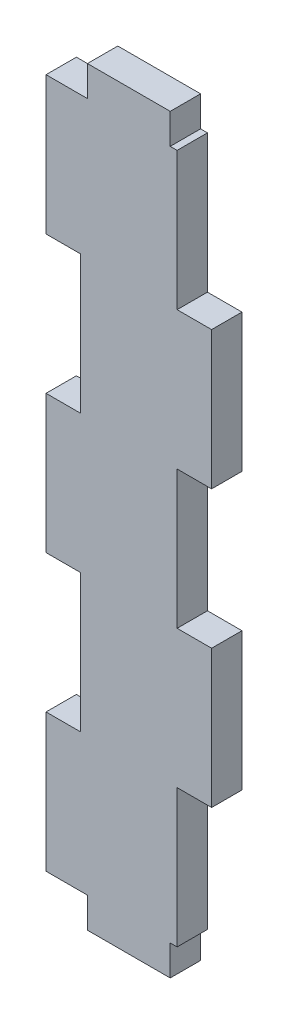
ISO-10303-21;
HEADER;
FILE_DESCRIPTION(('STEP AP214'),'2;1');
FILE_NAME('part.step','',(''),(''),'','','');
FILE_SCHEMA(('AUTOMOTIVE_DESIGN { 1 0 10303 214 1 1 1 1 }'));
ENDSEC;
DATA;
#1=APPLICATION_CONTEXT('core data for automotive mechanical design processes');
#2=APPLICATION_PROTOCOL_DEFINITION('international standard','automotive_design',2000,#1);
#3=PRODUCT_CONTEXT('',#1,'mechanical');
#4=PRODUCT('Part','Part','',(#3));
#5=PRODUCT_RELATED_PRODUCT_CATEGORY('part','',(#4));
#6=PRODUCT_DEFINITION_FORMATION('','',#4);
#7=PRODUCT_DEFINITION_CONTEXT('part definition',#1,'design');
#8=PRODUCT_DEFINITION('design','',#6,#7);
#9=PRODUCT_DEFINITION_SHAPE('','',#8);
#10=(LENGTH_UNIT() NAMED_UNIT(*) SI_UNIT(.MILLI.,.METRE.));
#11=(NAMED_UNIT(*) PLANE_ANGLE_UNIT() SI_UNIT($,.RADIAN.));
#12=(NAMED_UNIT(*) SI_UNIT($,.STERADIAN.) SOLID_ANGLE_UNIT());
#13=UNCERTAINTY_MEASURE_WITH_UNIT(LENGTH_MEASURE(1.E-05),#10,'distance_accuracy_value','');
#14=(GEOMETRIC_REPRESENTATION_CONTEXT(3) GLOBAL_UNCERTAINTY_ASSIGNED_CONTEXT((#13)) GLOBAL_UNIT_ASSIGNED_CONTEXT((#10,
#11,#12)) REPRESENTATION_CONTEXT('',''));
#15=CARTESIAN_POINT('',(0.,0.,0.));
#16=DIRECTION('',(0.,0.,1.));
#17=DIRECTION('',(1.,0.,0.));
#18=AXIS2_PLACEMENT_3D('',#15,#16,#17);
#19=CARTESIAN_POINT('',(7.,50.,4.4));
#20=DIRECTION('',(-1.,0.,0.));
#21=DIRECTION('',(0.,-1.,0.));
#22=AXIS2_PLACEMENT_3D('',#19,#20,#21);
#23=PLANE('',#22);
#24=DIRECTION('',(0.,1.,0.));
#25=VECTOR('',#24,1.);
#26=CARTESIAN_POINT('',(7.,50.,0.));
#27=LINE('',#26,#25);
#28=CARTESIAN_POINT('',(6.99999999999999,30.,0.));
#29=VERTEX_POINT('',#28);
#30=CARTESIAN_POINT('',(7.,50.,0.));
#31=VERTEX_POINT('',#30);
#32=EDGE_CURVE('E251',#29,#31,#27,.T.);
#33=ORIENTED_EDGE('',*,*,#32,.T.);
#34=DIRECTION('',(0.,0.,-1.));
#35=VECTOR('',#34,1.);
#36=CARTESIAN_POINT('',(7.,50.,4.4));
#37=LINE('',#36,#35);
#38=CARTESIAN_POINT('',(7.,50.,4.4));
#39=VERTEX_POINT('',#38);
#40=EDGE_CURVE('E11',#39,#31,#37,.T.);
#41=ORIENTED_EDGE('',*,*,#40,.F.);
#42=DIRECTION('',(0.,1.,0.));
#43=VECTOR('',#42,1.);
#44=CARTESIAN_POINT('',(7.,50.,4.4));
#45=LINE('',#44,#43);
#46=CARTESIAN_POINT('',(6.99999999999999,30.,4.4));
#47=VERTEX_POINT('',#46);
#48=EDGE_CURVE('E307',#47,#39,#45,.T.);
#49=ORIENTED_EDGE('',*,*,#48,.F.);
#50=DIRECTION('',(0.,0.,-1.));
#51=VECTOR('',#50,1.);
#52=CARTESIAN_POINT('',(6.99999999999999,30.,4.4));
#53=LINE('',#52,#51);
#54=EDGE_CURVE('E247',#47,#29,#53,.T.);
#55=ORIENTED_EDGE('',*,*,#54,.T.);
#56=EDGE_LOOP('',(#33,#41,#49,#55));
#57=FACE_BOUND('',#56,.T.);
#58=ADVANCED_FACE('F35',(#57),#23,.F.);
#59=CARTESIAN_POINT('',(6.,50.,4.4));
#60=DIRECTION('',(0.,-1.,0.));
#61=DIRECTION('',(0.,0.,-1.));
#62=AXIS2_PLACEMENT_3D('',#59,#60,#61);
#63=PLANE('',#62);
#64=DIRECTION('',(-1.,0.,0.));
#65=VECTOR('',#64,1.);
#66=CARTESIAN_POINT('',(6.,50.,0.));
#67=LINE('',#66,#65);
#68=CARTESIAN_POINT('',(6.,50.,0.));
#69=VERTEX_POINT('',#68);
#70=EDGE_CURVE('E254',#31,#69,#67,.T.);
#71=ORIENTED_EDGE('',*,*,#70,.T.);
#72=DIRECTION('',(0.,0.,-1.));
#73=VECTOR('',#72,1.);
#74=CARTESIAN_POINT('',(6.,50.,4.4));
#75=LINE('',#74,#73);
#76=CARTESIAN_POINT('',(6.,50.,4.4));
#77=VERTEX_POINT('',#76);
#78=EDGE_CURVE('E43',#77,#69,#75,.T.);
#79=ORIENTED_EDGE('',*,*,#78,.F.);
#80=DIRECTION('',(-1.,0.,0.));
#81=VECTOR('',#80,1.);
#82=CARTESIAN_POINT('',(6.,50.,4.4));
#83=LINE('',#82,#81);
#84=EDGE_CURVE('E154',#39,#77,#83,.T.);
#85=ORIENTED_EDGE('',*,*,#84,.F.);
#86=ORIENTED_EDGE('',*,*,#40,.T.);
#87=EDGE_LOOP('',(#71,#79,#85,#86));
#88=FACE_BOUND('',#87,.T.);
#89=ADVANCED_FACE('F464',(#88),#63,.F.);
#90=CARTESIAN_POINT('',(6.,50.,4.4));
#91=DIRECTION('',(-1.,0.,0.));
#92=DIRECTION('',(0.,0.,1.));
#93=AXIS2_PLACEMENT_3D('',#90,#91,#92);
#94=PLANE('',#93);
#95=DIRECTION('',(0.,1.,0.));
#96=VECTOR('',#95,1.);
#97=CARTESIAN_POINT('',(6.,50.,0.));
#98=LINE('',#97,#96);
#99=CARTESIAN_POINT('',(6.,54.4,0.));
#100=VERTEX_POINT('',#99);
#101=EDGE_CURVE('E256',#69,#100,#98,.T.);
#102=ORIENTED_EDGE('',*,*,#101,.T.);
#103=DIRECTION('',(0.,0.,-1.));
#104=VECTOR('',#103,1.);
#105=CARTESIAN_POINT('',(6.,54.4,4.4));
#106=LINE('',#105,#104);
#107=CARTESIAN_POINT('',(6.,54.4,4.4));
#108=VERTEX_POINT('',#107);
#109=EDGE_CURVE('E374',#108,#100,#106,.T.);
#110=ORIENTED_EDGE('',*,*,#109,.F.);
#111=DIRECTION('',(0.,1.,0.));
#112=VECTOR('',#111,1.);
#113=CARTESIAN_POINT('',(6.,50.,4.4));
#114=LINE('',#113,#112);
#115=EDGE_CURVE('E382',#77,#108,#114,.T.);
#116=ORIENTED_EDGE('',*,*,#115,.F.);
#117=ORIENTED_EDGE('',*,*,#78,.T.);
#118=EDGE_LOOP('',(#102,#110,#116,#117));
#119=FACE_BOUND('',#118,.T.);
#120=ADVANCED_FACE('F380',(#119),#94,.F.);
#121=CARTESIAN_POINT('',(6.,54.4,4.4));
#122=DIRECTION('',(0.,-1.,0.));
#123=DIRECTION('',(0.,0.,-1.));
#124=AXIS2_PLACEMENT_3D('',#121,#122,#123);
#125=PLANE('',#124);
#126=DIRECTION('',(-1.,0.,0.));
#127=VECTOR('',#126,1.);
#128=CARTESIAN_POINT('',(6.,54.4,0.));
#129=LINE('',#128,#127);
#130=CARTESIAN_POINT('',(-6.,54.4,0.));
#131=VERTEX_POINT('',#130);
#132=EDGE_CURVE('E258',#100,#131,#129,.T.);
#133=ORIENTED_EDGE('',*,*,#132,.T.);
#134=DIRECTION('',(0.,0.,-1.));
#135=VECTOR('',#134,1.);
#136=CARTESIAN_POINT('',(-6.,54.4,4.4));
#137=LINE('',#136,#135);
#138=CARTESIAN_POINT('',(-6.,54.4,4.4));
#139=VERTEX_POINT('',#138);
#140=EDGE_CURVE('E371',#139,#131,#137,.T.);
#141=ORIENTED_EDGE('',*,*,#140,.F.);
#142=DIRECTION('',(-1.,0.,0.));
#143=VECTOR('',#142,1.);
#144=CARTESIAN_POINT('',(6.,54.4,4.4));
#145=LINE('',#144,#143);
#146=EDGE_CURVE('E399',#108,#139,#145,.T.);
#147=ORIENTED_EDGE('',*,*,#146,.F.);
#148=ORIENTED_EDGE('',*,*,#109,.T.);
#149=EDGE_LOOP('',(#133,#141,#147,#148));
#150=FACE_BOUND('',#149,.T.);
#151=ADVANCED_FACE('F390',(#150),#125,.F.);
#152=CARTESIAN_POINT('',(-6.,50.,4.4));
#153=DIRECTION('',(1.,0.,0.));
#154=DIRECTION('',(0.,0.,-1.));
#155=AXIS2_PLACEMENT_3D('',#152,#153,#154);
#156=PLANE('',#155);
#157=DIRECTION('',(0.,-1.,0.));
#158=VECTOR('',#157,1.);
#159=CARTESIAN_POINT('',(-6.,50.,0.));
#160=LINE('',#159,#158);
#161=CARTESIAN_POINT('',(-6.,50.,0.));
#162=VERTEX_POINT('',#161);
#163=EDGE_CURVE('E260',#131,#162,#160,.T.);
#164=ORIENTED_EDGE('',*,*,#163,.T.);
#165=DIRECTION('',(0.,0.,-1.));
#166=VECTOR('',#165,1.);
#167=CARTESIAN_POINT('',(-6.,50.,4.4));
#168=LINE('',#167,#166);
#169=CARTESIAN_POINT('',(-6.,50.,4.4));
#170=VERTEX_POINT('',#169);
#171=EDGE_CURVE('E368',#170,#162,#168,.T.);
#172=ORIENTED_EDGE('',*,*,#171,.F.);
#173=DIRECTION('',(0.,-1.,0.));
#174=VECTOR('',#173,1.);
#175=CARTESIAN_POINT('',(-6.,50.,4.4));
#176=LINE('',#175,#174);
#177=EDGE_CURVE('E396',#139,#170,#176,.T.);
#178=ORIENTED_EDGE('',*,*,#177,.F.);
#179=ORIENTED_EDGE('',*,*,#140,.T.);
#180=EDGE_LOOP('',(#164,#172,#178,#179));
#181=FACE_BOUND('',#180,.T.);
#182=ADVANCED_FACE('F394',(#181),#156,.F.);
#183=CARTESIAN_POINT('',(-7.00000000000001,50.,4.4));
#184=DIRECTION('',(0.,-1.,0.));
#185=DIRECTION('',(0.,0.,-1.));
#186=AXIS2_PLACEMENT_3D('',#183,#184,#185);
#187=PLANE('',#186);
#188=DIRECTION('',(-1.,0.,0.));
#189=VECTOR('',#188,1.);
#190=CARTESIAN_POINT('',(-7.00000000000001,50.,0.));
#191=LINE('',#190,#189);
#192=CARTESIAN_POINT('',(-12.,50.,0.));
#193=VERTEX_POINT('',#192);
#194=EDGE_CURVE('E263',#162,#193,#191,.T.);
#195=ORIENTED_EDGE('',*,*,#194,.T.);
#196=DIRECTION('',(0.,0.,-1.));
#197=VECTOR('',#196,1.);
#198=CARTESIAN_POINT('',(-12.,50.,4.4));
#199=LINE('',#198,#197);
#200=CARTESIAN_POINT('',(-12.,50.,4.4));
#201=VERTEX_POINT('',#200);
#202=EDGE_CURVE('E365',#201,#193,#199,.T.);
#203=ORIENTED_EDGE('',*,*,#202,.F.);
#204=DIRECTION('',(-1.,0.,0.));
#205=VECTOR('',#204,1.);
#206=CARTESIAN_POINT('',(-7.00000000000001,50.,4.4));
#207=LINE('',#206,#205);
#208=EDGE_CURVE('E398',#170,#201,#207,.T.);
#209=ORIENTED_EDGE('',*,*,#208,.F.);
#210=ORIENTED_EDGE('',*,*,#171,.T.);
#211=EDGE_LOOP('',(#195,#203,#209,#210));
#212=FACE_BOUND('',#211,.T.);
#213=ADVANCED_FACE('F477',(#212),#187,.F.);
#214=CARTESIAN_POINT('',(-12.,50.,4.4));
#215=DIRECTION('',(1.,0.,0.));
#216=DIRECTION('',(0.,0.,-1.));
#217=AXIS2_PLACEMENT_3D('',#214,#215,#216);
#218=PLANE('',#217);
#219=DIRECTION('',(0.,-1.,0.));
#220=VECTOR('',#219,1.);
#221=CARTESIAN_POINT('',(-12.,50.,0.));
#222=LINE('',#221,#220);
#223=CARTESIAN_POINT('',(-12.,30.,0.));
#224=VERTEX_POINT('',#223);
#225=EDGE_CURVE('E265',#193,#224,#222,.T.);
#226=ORIENTED_EDGE('',*,*,#225,.T.);
#227=DIRECTION('',(0.,0.,-1.));
#228=VECTOR('',#227,1.);
#229=CARTESIAN_POINT('',(-12.,30.,4.4));
#230=LINE('',#229,#228);
#231=CARTESIAN_POINT('',(-12.,30.,4.4));
#232=VERTEX_POINT('',#231);
#233=EDGE_CURVE('E362',#232,#224,#230,.T.);
#234=ORIENTED_EDGE('',*,*,#233,.F.);
#235=DIRECTION('',(0.,-1.,0.));
#236=VECTOR('',#235,1.);
#237=CARTESIAN_POINT('',(-12.,50.,4.4));
#238=LINE('',#237,#236);
#239=EDGE_CURVE('E401',#201,#232,#238,.T.);
#240=ORIENTED_EDGE('',*,*,#239,.F.);
#241=ORIENTED_EDGE('',*,*,#202,.T.);
#242=EDGE_LOOP('',(#226,#234,#240,#241));
#243=FACE_BOUND('',#242,.T.);
#244=ADVANCED_FACE('F480',(#243),#218,.F.);
#245=CARTESIAN_POINT('',(-12.,30.,4.4));
#246=DIRECTION('',(0.,1.,0.));
#247=DIRECTION('',(-1.,0.,0.));
#248=AXIS2_PLACEMENT_3D('',#245,#246,#247);
#249=PLANE('',#248);
#250=DIRECTION('',(1.,0.,0.));
#251=VECTOR('',#250,1.);
#252=CARTESIAN_POINT('',(-12.,30.,0.));
#253=LINE('',#252,#251);
#254=CARTESIAN_POINT('',(-7.00000000000001,30.,0.));
#255=VERTEX_POINT('',#254);
#256=EDGE_CURVE('E267',#224,#255,#253,.T.);
#257=ORIENTED_EDGE('',*,*,#256,.T.);
#258=DIRECTION('',(0.,0.,-1.));
#259=VECTOR('',#258,1.);
#260=CARTESIAN_POINT('',(-7.00000000000001,30.,4.4));
#261=LINE('',#260,#259);
#262=CARTESIAN_POINT('',(-7.00000000000001,30.,4.4));
#263=VERTEX_POINT('',#262);
#264=EDGE_CURVE('E359',#263,#255,#261,.T.);
#265=ORIENTED_EDGE('',*,*,#264,.F.);
#266=DIRECTION('',(1.,0.,0.));
#267=VECTOR('',#266,1.);
#268=CARTESIAN_POINT('',(-12.,30.,4.4));
#269=LINE('',#268,#267);
#270=EDGE_CURVE('E407',#232,#263,#269,.T.);
#271=ORIENTED_EDGE('',*,*,#270,.F.);
#272=ORIENTED_EDGE('',*,*,#233,.T.);
#273=EDGE_LOOP('',(#257,#265,#271,#272));
#274=FACE_BOUND('',#273,.T.);
#275=ADVANCED_FACE('F484',(#274),#249,.F.);
#276=CARTESIAN_POINT('',(-7.00000000000001,30.,4.4));
#277=DIRECTION('',(1.,0.,0.));
#278=DIRECTION('',(0.,1.,0.));
#279=AXIS2_PLACEMENT_3D('',#276,#277,#278);
#280=PLANE('',#279);
#281=DIRECTION('',(0.,-1.,0.));
#282=VECTOR('',#281,1.);
#283=CARTESIAN_POINT('',(-7.00000000000001,30.,0.));
#284=LINE('',#283,#282);
#285=CARTESIAN_POINT('',(-7.00000000000001,10.,0.));
#286=VERTEX_POINT('',#285);
#287=EDGE_CURVE('E269',#255,#286,#284,.T.);
#288=ORIENTED_EDGE('',*,*,#287,.T.);
#289=DIRECTION('',(0.,0.,-1.));
#290=VECTOR('',#289,1.);
#291=CARTESIAN_POINT('',(-7.00000000000001,10.,4.4));
#292=LINE('',#291,#290);
#293=CARTESIAN_POINT('',(-7.00000000000001,10.,4.4));
#294=VERTEX_POINT('',#293);
#295=EDGE_CURVE('E356',#294,#286,#292,.T.);
#296=ORIENTED_EDGE('',*,*,#295,.F.);
#297=DIRECTION('',(0.,-1.,0.));
#298=VECTOR('',#297,1.);
#299=CARTESIAN_POINT('',(-7.00000000000001,30.,4.4));
#300=LINE('',#299,#298);
#301=EDGE_CURVE('E409',#263,#294,#300,.T.);
#302=ORIENTED_EDGE('',*,*,#301,.F.);
#303=ORIENTED_EDGE('',*,*,#264,.T.);
#304=EDGE_LOOP('',(#288,#296,#302,#303));
#305=FACE_BOUND('',#304,.T.);
#306=ADVANCED_FACE('F488',(#305),#280,.F.);
#307=CARTESIAN_POINT('',(-7.00000000000001,10.,4.4));
#308=DIRECTION('',(0.,-1.,0.));
#309=DIRECTION('',(0.,0.,-1.));
#310=AXIS2_PLACEMENT_3D('',#307,#308,#309);
#311=PLANE('',#310);
#312=DIRECTION('',(-1.,0.,0.));
#313=VECTOR('',#312,1.);
#314=CARTESIAN_POINT('',(-7.00000000000001,10.,0.));
#315=LINE('',#314,#313);
#316=CARTESIAN_POINT('',(-12.,10.,0.));
#317=VERTEX_POINT('',#316);
#318=EDGE_CURVE('E271',#286,#317,#315,.T.);
#319=ORIENTED_EDGE('',*,*,#318,.T.);
#320=DIRECTION('',(0.,0.,-1.));
#321=VECTOR('',#320,1.);
#322=CARTESIAN_POINT('',(-12.,10.,4.4));
#323=LINE('',#322,#321);
#324=CARTESIAN_POINT('',(-12.,10.,4.4));
#325=VERTEX_POINT('',#324);
#326=EDGE_CURVE('E353',#325,#317,#323,.T.);
#327=ORIENTED_EDGE('',*,*,#326,.F.);
#328=DIRECTION('',(-1.,0.,0.));
#329=VECTOR('',#328,1.);
#330=CARTESIAN_POINT('',(-7.00000000000001,10.,4.4));
#331=LINE('',#330,#329);
#332=EDGE_CURVE('E411',#294,#325,#331,.T.);
#333=ORIENTED_EDGE('',*,*,#332,.F.);
#334=ORIENTED_EDGE('',*,*,#295,.T.);
#335=EDGE_LOOP('',(#319,#327,#333,#334));
#336=FACE_BOUND('',#335,.T.);
#337=ADVANCED_FACE('F492',(#336),#311,.F.);
#338=CARTESIAN_POINT('',(-12.,10.,4.4));
#339=DIRECTION('',(1.,0.,0.));
#340=DIRECTION('',(0.,0.,-1.));
#341=AXIS2_PLACEMENT_3D('',#338,#339,#340);
#342=PLANE('',#341);
#343=DIRECTION('',(0.,-1.,0.));
#344=VECTOR('',#343,1.);
#345=CARTESIAN_POINT('',(-12.,10.,0.));
#346=LINE('',#345,#344);
#347=CARTESIAN_POINT('',(-12.,-10.,0.));
#348=VERTEX_POINT('',#347);
#349=EDGE_CURVE('E273',#317,#348,#346,.T.);
#350=ORIENTED_EDGE('',*,*,#349,.T.);
#351=DIRECTION('',(0.,0.,-1.));
#352=VECTOR('',#351,1.);
#353=CARTESIAN_POINT('',(-12.,-10.,4.4));
#354=LINE('',#353,#352);
#355=CARTESIAN_POINT('',(-12.,-10.,4.4));
#356=VERTEX_POINT('',#355);
#357=EDGE_CURVE('E350',#356,#348,#354,.T.);
#358=ORIENTED_EDGE('',*,*,#357,.F.);
#359=DIRECTION('',(0.,-1.,0.));
#360=VECTOR('',#359,1.);
#361=CARTESIAN_POINT('',(-12.,10.,4.4));
#362=LINE('',#361,#360);
#363=EDGE_CURVE('E413',#325,#356,#362,.T.);
#364=ORIENTED_EDGE('',*,*,#363,.F.);
#365=ORIENTED_EDGE('',*,*,#326,.T.);
#366=EDGE_LOOP('',(#350,#358,#364,#365));
#367=FACE_BOUND('',#366,.T.);
#368=ADVANCED_FACE('F496',(#367),#342,.F.);
#369=CARTESIAN_POINT('',(-12.,-10.,4.4));
#370=DIRECTION('',(0.,1.,0.));
#371=DIRECTION('',(-1.,0.,0.));
#372=AXIS2_PLACEMENT_3D('',#369,#370,#371);
#373=PLANE('',#372);
#374=DIRECTION('',(1.,0.,0.));
#375=VECTOR('',#374,1.);
#376=CARTESIAN_POINT('',(-12.,-10.,0.));
#377=LINE('',#376,#375);
#378=CARTESIAN_POINT('',(-7.00000000000001,-10.,0.));
#379=VERTEX_POINT('',#378);
#380=EDGE_CURVE('E275',#348,#379,#377,.T.);
#381=ORIENTED_EDGE('',*,*,#380,.T.);
#382=DIRECTION('',(0.,0.,-1.));
#383=VECTOR('',#382,1.);
#384=CARTESIAN_POINT('',(-7.00000000000001,-10.,4.4));
#385=LINE('',#384,#383);
#386=CARTESIAN_POINT('',(-7.00000000000001,-10.,4.4));
#387=VERTEX_POINT('',#386);
#388=EDGE_CURVE('E347',#387,#379,#385,.T.);
#389=ORIENTED_EDGE('',*,*,#388,.F.);
#390=DIRECTION('',(1.,0.,0.));
#391=VECTOR('',#390,1.);
#392=CARTESIAN_POINT('',(-12.,-10.,4.4));
#393=LINE('',#392,#391);
#394=EDGE_CURVE('E415',#356,#387,#393,.T.);
#395=ORIENTED_EDGE('',*,*,#394,.F.);
#396=ORIENTED_EDGE('',*,*,#357,.T.);
#397=EDGE_LOOP('',(#381,#389,#395,#396));
#398=FACE_BOUND('',#397,.T.);
#399=ADVANCED_FACE('F500',(#398),#373,.F.);
#400=CARTESIAN_POINT('',(-7.00000000000001,-30.,4.4));
#401=DIRECTION('',(1.,0.,0.));
#402=DIRECTION('',(0.,1.,0.));
#403=AXIS2_PLACEMENT_3D('',#400,#401,#402);
#404=PLANE('',#403);
#405=DIRECTION('',(0.,-1.,0.));
#406=VECTOR('',#405,1.);
#407=CARTESIAN_POINT('',(-7.00000000000001,-30.,0.));
#408=LINE('',#407,#406);
#409=CARTESIAN_POINT('',(-7.00000000000001,-30.,0.));
#410=VERTEX_POINT('',#409);
#411=EDGE_CURVE('E277',#379,#410,#408,.T.);
#412=ORIENTED_EDGE('',*,*,#411,.T.);
#413=DIRECTION('',(0.,0.,-1.));
#414=VECTOR('',#413,1.);
#415=CARTESIAN_POINT('',(-7.00000000000001,-30.,4.4));
#416=LINE('',#415,#414);
#417=CARTESIAN_POINT('',(-7.00000000000001,-30.,4.4));
#418=VERTEX_POINT('',#417);
#419=EDGE_CURVE('E344',#418,#410,#416,.T.);
#420=ORIENTED_EDGE('',*,*,#419,.F.);
#421=DIRECTION('',(0.,-1.,0.));
#422=VECTOR('',#421,1.);
#423=CARTESIAN_POINT('',(-7.00000000000001,-30.,4.4));
#424=LINE('',#423,#422);
#425=EDGE_CURVE('E417',#387,#418,#424,.T.);
#426=ORIENTED_EDGE('',*,*,#425,.F.);
#427=ORIENTED_EDGE('',*,*,#388,.T.);
#428=EDGE_LOOP('',(#412,#420,#426,#427));
#429=FACE_BOUND('',#428,.T.);
#430=ADVANCED_FACE('F504',(#429),#404,.F.);
#431=CARTESIAN_POINT('',(-7.00000000000001,-30.,4.4));
#432=DIRECTION('',(0.,-1.,0.));
#433=DIRECTION('',(0.,0.,-1.));
#434=AXIS2_PLACEMENT_3D('',#431,#432,#433);
#435=PLANE('',#434);
#436=DIRECTION('',(-1.,0.,0.));
#437=VECTOR('',#436,1.);
#438=CARTESIAN_POINT('',(-7.00000000000001,-30.,0.));
#439=LINE('',#438,#437);
#440=CARTESIAN_POINT('',(-12.,-30.,0.));
#441=VERTEX_POINT('',#440);
#442=EDGE_CURVE('E279',#410,#441,#439,.T.);
#443=ORIENTED_EDGE('',*,*,#442,.T.);
#444=DIRECTION('',(0.,0.,-1.));
#445=VECTOR('',#444,1.);
#446=CARTESIAN_POINT('',(-12.,-30.,4.4));
#447=LINE('',#446,#445);
#448=CARTESIAN_POINT('',(-12.,-30.,4.4));
#449=VERTEX_POINT('',#448);
#450=EDGE_CURVE('E341',#449,#441,#447,.T.);
#451=ORIENTED_EDGE('',*,*,#450,.F.);
#452=DIRECTION('',(-1.,0.,0.));
#453=VECTOR('',#452,1.);
#454=CARTESIAN_POINT('',(-7.00000000000001,-30.,4.4));
#455=LINE('',#454,#453);
#456=EDGE_CURVE('E419',#418,#449,#455,.T.);
#457=ORIENTED_EDGE('',*,*,#456,.F.);
#458=ORIENTED_EDGE('',*,*,#419,.T.);
#459=EDGE_LOOP('',(#443,#451,#457,#458));
#460=FACE_BOUND('',#459,.T.);
#461=ADVANCED_FACE('F508',(#460),#435,.F.);
#462=CARTESIAN_POINT('',(-12.,-30.,4.4));
#463=DIRECTION('',(1.,0.,0.));
#464=DIRECTION('',(0.,0.,-1.));
#465=AXIS2_PLACEMENT_3D('',#462,#463,#464);
#466=PLANE('',#465);
#467=DIRECTION('',(0.,-1.,0.));
#468=VECTOR('',#467,1.);
#469=CARTESIAN_POINT('',(-12.,-30.,0.));
#470=LINE('',#469,#468);
#471=CARTESIAN_POINT('',(-12.,-50.,0.));
#472=VERTEX_POINT('',#471);
#473=EDGE_CURVE('E281',#441,#472,#470,.T.);
#474=ORIENTED_EDGE('',*,*,#473,.T.);
#475=DIRECTION('',(0.,0.,-1.));
#476=VECTOR('',#475,1.);
#477=CARTESIAN_POINT('',(-12.,-50.,4.4));
#478=LINE('',#477,#476);
#479=CARTESIAN_POINT('',(-12.,-50.,4.4));
#480=VERTEX_POINT('',#479);
#481=EDGE_CURVE('E338',#480,#472,#478,.T.);
#482=ORIENTED_EDGE('',*,*,#481,.F.);
#483=DIRECTION('',(0.,-1.,0.));
#484=VECTOR('',#483,1.);
#485=CARTESIAN_POINT('',(-12.,-30.,4.4));
#486=LINE('',#485,#484);
#487=EDGE_CURVE('E421',#449,#480,#486,.T.);
#488=ORIENTED_EDGE('',*,*,#487,.F.);
#489=ORIENTED_EDGE('',*,*,#450,.T.);
#490=EDGE_LOOP('',(#474,#482,#488,#489));
#491=FACE_BOUND('',#490,.T.);
#492=ADVANCED_FACE('F512',(#491),#466,.F.);
#493=CARTESIAN_POINT('',(-7.00000000000001,-50.,4.4));
#494=DIRECTION('',(0.,1.,0.));
#495=DIRECTION('',(0.,0.,1.));
#496=AXIS2_PLACEMENT_3D('',#493,#494,#495);
#497=PLANE('',#496);
#498=DIRECTION('',(1.,0.,0.));
#499=VECTOR('',#498,1.);
#500=CARTESIAN_POINT('',(-7.00000000000001,-50.,0.));
#501=LINE('',#500,#499);
#502=CARTESIAN_POINT('',(-6.,-50.,0.));
#503=VERTEX_POINT('',#502);
#504=EDGE_CURVE('E284',#472,#503,#501,.T.);
#505=ORIENTED_EDGE('',*,*,#504,.T.);
#506=DIRECTION('',(0.,0.,-1.));
#507=VECTOR('',#506,1.);
#508=CARTESIAN_POINT('',(-6.,-50.,4.4));
#509=LINE('',#508,#507);
#510=CARTESIAN_POINT('',(-6.,-50.,4.4));
#511=VERTEX_POINT('',#510);
#512=EDGE_CURVE('E335',#511,#503,#509,.T.);
#513=ORIENTED_EDGE('',*,*,#512,.F.);
#514=DIRECTION('',(1.,0.,0.));
#515=VECTOR('',#514,1.);
#516=CARTESIAN_POINT('',(-12.,-50.,4.4));
#517=LINE('',#516,#515);
#518=EDGE_CURVE('E423',#480,#511,#517,.T.);
#519=ORIENTED_EDGE('',*,*,#518,.F.);
#520=ORIENTED_EDGE('',*,*,#481,.T.);
#521=EDGE_LOOP('',(#505,#513,#519,#520));
#522=FACE_BOUND('',#521,.T.);
#523=ADVANCED_FACE('F516',(#522),#497,.F.);
#524=CARTESIAN_POINT('',(-6.,-50.,4.4));
#525=DIRECTION('',(1.,0.,0.));
#526=DIRECTION('',(0.,0.,-1.));
#527=AXIS2_PLACEMENT_3D('',#524,#525,#526);
#528=PLANE('',#527);
#529=DIRECTION('',(0.,-1.,0.));
#530=VECTOR('',#529,1.);
#531=CARTESIAN_POINT('',(-6.,-50.,0.));
#532=LINE('',#531,#530);
#533=CARTESIAN_POINT('',(-6.,-54.4,0.));
#534=VERTEX_POINT('',#533);
#535=EDGE_CURVE('E286',#503,#534,#532,.T.);
#536=ORIENTED_EDGE('',*,*,#535,.T.);
#537=DIRECTION('',(0.,0.,-1.));
#538=VECTOR('',#537,1.);
#539=CARTESIAN_POINT('',(-6.,-54.4,4.4));
#540=LINE('',#539,#538);
#541=CARTESIAN_POINT('',(-6.,-54.4,4.4));
#542=VERTEX_POINT('',#541);
#543=EDGE_CURVE('E332',#542,#534,#540,.T.);
#544=ORIENTED_EDGE('',*,*,#543,.F.);
#545=DIRECTION('',(0.,-1.,0.));
#546=VECTOR('',#545,1.);
#547=CARTESIAN_POINT('',(-6.,-50.,4.4));
#548=LINE('',#547,#546);
#549=EDGE_CURVE('E425',#511,#542,#548,.T.);
#550=ORIENTED_EDGE('',*,*,#549,.F.);
#551=ORIENTED_EDGE('',*,*,#512,.T.);
#552=EDGE_LOOP('',(#536,#544,#550,#551));
#553=FACE_BOUND('',#552,.T.);
#554=ADVANCED_FACE('F520',(#553),#528,.F.);
#555=CARTESIAN_POINT('',(6.,-54.4,4.4));
#556=DIRECTION('',(0.,1.,0.));
#557=DIRECTION('',(0.,0.,1.));
#558=AXIS2_PLACEMENT_3D('',#555,#556,#557);
#559=PLANE('',#558);
#560=DIRECTION('',(1.,0.,0.));
#561=VECTOR('',#560,1.);
#562=CARTESIAN_POINT('',(6.,-54.4,0.));
#563=LINE('',#562,#561);
#564=CARTESIAN_POINT('',(6.,-54.4,0.));
#565=VERTEX_POINT('',#564);
#566=EDGE_CURVE('E288',#534,#565,#563,.T.);
#567=ORIENTED_EDGE('',*,*,#566,.T.);
#568=DIRECTION('',(0.,0.,-1.));
#569=VECTOR('',#568,1.);
#570=CARTESIAN_POINT('',(6.,-54.4,4.4));
#571=LINE('',#570,#569);
#572=CARTESIAN_POINT('',(6.,-54.4,4.4));
#573=VERTEX_POINT('',#572);
#574=EDGE_CURVE('E329',#573,#565,#571,.T.);
#575=ORIENTED_EDGE('',*,*,#574,.F.);
#576=DIRECTION('',(1.,0.,0.));
#577=VECTOR('',#576,1.);
#578=CARTESIAN_POINT('',(6.,-54.4,4.4));
#579=LINE('',#578,#577);
#580=EDGE_CURVE('E427',#542,#573,#579,.T.);
#581=ORIENTED_EDGE('',*,*,#580,.F.);
#582=ORIENTED_EDGE('',*,*,#543,.T.);
#583=EDGE_LOOP('',(#567,#575,#581,#582));
#584=FACE_BOUND('',#583,.T.);
#585=ADVANCED_FACE('F524',(#584),#559,.F.);
#586=CARTESIAN_POINT('',(6.,-50.,4.4));
#587=DIRECTION('',(-1.,0.,0.));
#588=DIRECTION('',(0.,0.,1.));
#589=AXIS2_PLACEMENT_3D('',#586,#587,#588);
#590=PLANE('',#589);
#591=DIRECTION('',(0.,1.,0.));
#592=VECTOR('',#591,1.);
#593=CARTESIAN_POINT('',(6.,-50.,0.));
#594=LINE('',#593,#592);
#595=CARTESIAN_POINT('',(6.,-50.,0.));
#596=VERTEX_POINT('',#595);
#597=EDGE_CURVE('E290',#565,#596,#594,.T.);
#598=ORIENTED_EDGE('',*,*,#597,.T.);
#599=DIRECTION('',(0.,0.,-1.));
#600=VECTOR('',#599,1.);
#601=CARTESIAN_POINT('',(6.,-50.,4.4));
#602=LINE('',#601,#600);
#603=CARTESIAN_POINT('',(6.,-50.,4.4));
#604=VERTEX_POINT('',#603);
#605=EDGE_CURVE('E326',#604,#596,#602,.T.);
#606=ORIENTED_EDGE('',*,*,#605,.F.);
#607=DIRECTION('',(0.,1.,0.));
#608=VECTOR('',#607,1.);
#609=CARTESIAN_POINT('',(6.,-50.,4.4));
#610=LINE('',#609,#608);
#611=EDGE_CURVE('E429',#573,#604,#610,.T.);
#612=ORIENTED_EDGE('',*,*,#611,.F.);
#613=ORIENTED_EDGE('',*,*,#574,.T.);
#614=EDGE_LOOP('',(#598,#606,#612,#613));
#615=FACE_BOUND('',#614,.T.);
#616=ADVANCED_FACE('F528',(#615),#590,.F.);
#617=CARTESIAN_POINT('',(6.,-50.,4.4));
#618=DIRECTION('',(0.,1.,0.));
#619=DIRECTION('',(0.,0.,1.));
#620=AXIS2_PLACEMENT_3D('',#617,#618,#619);
#621=PLANE('',#620);
#622=DIRECTION('',(1.,0.,0.));
#623=VECTOR('',#622,1.);
#624=CARTESIAN_POINT('',(6.,-50.,0.));
#625=LINE('',#624,#623);
#626=CARTESIAN_POINT('',(7.,-50.,0.));
#627=VERTEX_POINT('',#626);
#628=EDGE_CURVE('E292',#596,#627,#625,.T.);
#629=ORIENTED_EDGE('',*,*,#628,.T.);
#630=DIRECTION('',(0.,0.,-1.));
#631=VECTOR('',#630,1.);
#632=CARTESIAN_POINT('',(7.,-50.,4.4));
#633=LINE('',#632,#631);
#634=CARTESIAN_POINT('',(7.,-50.,4.4));
#635=VERTEX_POINT('',#634);
#636=EDGE_CURVE('E323',#635,#627,#633,.T.);
#637=ORIENTED_EDGE('',*,*,#636,.F.);
#638=DIRECTION('',(1.,0.,0.));
#639=VECTOR('',#638,1.);
#640=CARTESIAN_POINT('',(6.,-50.,4.4));
#641=LINE('',#640,#639);
#642=EDGE_CURVE('E431',#604,#635,#641,.T.);
#643=ORIENTED_EDGE('',*,*,#642,.F.);
#644=ORIENTED_EDGE('',*,*,#605,.T.);
#645=EDGE_LOOP('',(#629,#637,#643,#644));
#646=FACE_BOUND('',#645,.T.);
#647=ADVANCED_FACE('F532',(#646),#621,.F.);
#648=CARTESIAN_POINT('',(7.,-30.,4.4));
#649=DIRECTION('',(-1.,0.,0.));
#650=DIRECTION('',(0.,-1.,0.));
#651=AXIS2_PLACEMENT_3D('',#648,#649,#650);
#652=PLANE('',#651);
#653=DIRECTION('',(0.,1.,0.));
#654=VECTOR('',#653,1.);
#655=CARTESIAN_POINT('',(7.,-30.,0.));
#656=LINE('',#655,#654);
#657=CARTESIAN_POINT('',(7.,-30.,0.));
#658=VERTEX_POINT('',#657);
#659=EDGE_CURVE('E294',#627,#658,#656,.T.);
#660=ORIENTED_EDGE('',*,*,#659,.T.);
#661=DIRECTION('',(0.,0.,-1.));
#662=VECTOR('',#661,1.);
#663=CARTESIAN_POINT('',(7.,-30.,4.4));
#664=LINE('',#663,#662);
#665=CARTESIAN_POINT('',(7.,-30.,4.4));
#666=VERTEX_POINT('',#665);
#667=EDGE_CURVE('E320',#666,#658,#664,.T.);
#668=ORIENTED_EDGE('',*,*,#667,.F.);
#669=DIRECTION('',(0.,1.,0.));
#670=VECTOR('',#669,1.);
#671=CARTESIAN_POINT('',(7.,-30.,4.4));
#672=LINE('',#671,#670);
#673=EDGE_CURVE('E433',#635,#666,#672,.T.);
#674=ORIENTED_EDGE('',*,*,#673,.F.);
#675=ORIENTED_EDGE('',*,*,#636,.T.);
#676=EDGE_LOOP('',(#660,#668,#674,#675));
#677=FACE_BOUND('',#676,.T.);
#678=ADVANCED_FACE('F536',(#677),#652,.F.);
#679=CARTESIAN_POINT('',(12.,-30.,4.4));
#680=DIRECTION('',(0.,1.,0.));
#681=DIRECTION('',(0.,0.,1.));
#682=AXIS2_PLACEMENT_3D('',#679,#680,#681);
#683=PLANE('',#682);
#684=DIRECTION('',(1.,0.,0.));
#685=VECTOR('',#684,1.);
#686=CARTESIAN_POINT('',(12.,-30.,0.));
#687=LINE('',#686,#685);
#688=CARTESIAN_POINT('',(12.,-30.,0.));
#689=VERTEX_POINT('',#688);
#690=EDGE_CURVE('E296',#658,#689,#687,.T.);
#691=ORIENTED_EDGE('',*,*,#690,.T.);
#692=DIRECTION('',(0.,0.,-1.));
#693=VECTOR('',#692,1.);
#694=CARTESIAN_POINT('',(12.,-30.,4.4));
#695=LINE('',#694,#693);
#696=CARTESIAN_POINT('',(12.,-30.,4.4));
#697=VERTEX_POINT('',#696);
#698=EDGE_CURVE('E317',#697,#689,#695,.T.);
#699=ORIENTED_EDGE('',*,*,#698,.F.);
#700=DIRECTION('',(1.,0.,0.));
#701=VECTOR('',#700,1.);
#702=CARTESIAN_POINT('',(12.,-30.,4.4));
#703=LINE('',#702,#701);
#704=EDGE_CURVE('E435',#666,#697,#703,.T.);
#705=ORIENTED_EDGE('',*,*,#704,.F.);
#706=ORIENTED_EDGE('',*,*,#667,.T.);
#707=EDGE_LOOP('',(#691,#699,#705,#706));
#708=FACE_BOUND('',#707,.T.);
#709=ADVANCED_FACE('F540',(#708),#683,.F.);
#710=CARTESIAN_POINT('',(12.,-10.,4.4));
#711=DIRECTION('',(-1.,0.,0.));
#712=DIRECTION('',(0.,-1.,0.));
#713=AXIS2_PLACEMENT_3D('',#710,#711,#712);
#714=PLANE('',#713);
#715=DIRECTION('',(0.,1.,0.));
#716=VECTOR('',#715,1.);
#717=CARTESIAN_POINT('',(12.,-10.,0.));
#718=LINE('',#717,#716);
#719=CARTESIAN_POINT('',(12.,-10.,0.));
#720=VERTEX_POINT('',#719);
#721=EDGE_CURVE('E298',#689,#720,#718,.T.);
#722=ORIENTED_EDGE('',*,*,#721,.T.);
#723=DIRECTION('',(0.,0.,-1.));
#724=VECTOR('',#723,1.);
#725=CARTESIAN_POINT('',(12.,-10.,4.4));
#726=LINE('',#725,#724);
#727=CARTESIAN_POINT('',(12.,-10.,4.4));
#728=VERTEX_POINT('',#727);
#729=EDGE_CURVE('E314',#728,#720,#726,.T.);
#730=ORIENTED_EDGE('',*,*,#729,.F.);
#731=DIRECTION('',(0.,1.,0.));
#732=VECTOR('',#731,1.);
#733=CARTESIAN_POINT('',(12.,-10.,4.4));
#734=LINE('',#733,#732);
#735=EDGE_CURVE('E437',#697,#728,#734,.T.);
#736=ORIENTED_EDGE('',*,*,#735,.F.);
#737=ORIENTED_EDGE('',*,*,#698,.T.);
#738=EDGE_LOOP('',(#722,#730,#736,#737));
#739=FACE_BOUND('',#738,.T.);
#740=ADVANCED_FACE('F544',(#739),#714,.F.);
#741=CARTESIAN_POINT('',(7.,-10.,4.4));
#742=DIRECTION('',(0.,-1.,0.));
#743=DIRECTION('',(0.,0.,-1.));
#744=AXIS2_PLACEMENT_3D('',#741,#742,#743);
#745=PLANE('',#744);
#746=DIRECTION('',(-1.,0.,0.));
#747=VECTOR('',#746,1.);
#748=CARTESIAN_POINT('',(7.,-10.,0.));
#749=LINE('',#748,#747);
#750=CARTESIAN_POINT('',(7.,-10.,0.));
#751=VERTEX_POINT('',#750);
#752=EDGE_CURVE('E300',#720,#751,#749,.T.);
#753=ORIENTED_EDGE('',*,*,#752,.T.);
#754=DIRECTION('',(0.,0.,-1.));
#755=VECTOR('',#754,1.);
#756=CARTESIAN_POINT('',(7.,-10.,4.4));
#757=LINE('',#756,#755);
#758=CARTESIAN_POINT('',(7.,-10.,4.4));
#759=VERTEX_POINT('',#758);
#760=EDGE_CURVE('E311',#759,#751,#757,.T.);
#761=ORIENTED_EDGE('',*,*,#760,.F.);
#762=DIRECTION('',(-1.,0.,0.));
#763=VECTOR('',#762,1.);
#764=CARTESIAN_POINT('',(7.,-10.,4.4));
#765=LINE('',#764,#763);
#766=EDGE_CURVE('E439',#728,#759,#765,.T.);
#767=ORIENTED_EDGE('',*,*,#766,.F.);
#768=ORIENTED_EDGE('',*,*,#729,.T.);
#769=EDGE_LOOP('',(#753,#761,#767,#768));
#770=FACE_BOUND('',#769,.T.);
#771=ADVANCED_FACE('F445',(#770),#745,.F.);
#772=CARTESIAN_POINT('',(7.,-10.,4.4));
#773=DIRECTION('',(-1.,0.,0.));
#774=DIRECTION('',(0.,-1.,0.));
#775=AXIS2_PLACEMENT_3D('',#772,#773,#774);
#776=PLANE('',#775);
#777=DIRECTION('',(0.,1.,0.));
#778=VECTOR('',#777,1.);
#779=CARTESIAN_POINT('',(7.,-10.,0.));
#780=LINE('',#779,#778);
#781=CARTESIAN_POINT('',(6.99999999999999,10.,0.));
#782=VERTEX_POINT('',#781);
#783=EDGE_CURVE('E302',#751,#782,#780,.T.);
#784=ORIENTED_EDGE('',*,*,#783,.T.);
#785=DIRECTION('',(0.,0.,-1.));
#786=VECTOR('',#785,1.);
#787=CARTESIAN_POINT('',(6.99999999999999,10.,4.4));
#788=LINE('',#787,#786);
#789=CARTESIAN_POINT('',(6.99999999999999,10.,4.4));
#790=VERTEX_POINT('',#789);
#791=EDGE_CURVE('E242',#790,#782,#788,.T.);
#792=ORIENTED_EDGE('',*,*,#791,.F.);
#793=DIRECTION('',(0.,1.,0.));
#794=VECTOR('',#793,1.);
#795=CARTESIAN_POINT('',(7.,-10.,4.4));
#796=LINE('',#795,#794);
#797=EDGE_CURVE('E233',#759,#790,#796,.T.);
#798=ORIENTED_EDGE('',*,*,#797,.F.);
#799=ORIENTED_EDGE('',*,*,#760,.T.);
#800=EDGE_LOOP('',(#784,#792,#798,#799));
#801=FACE_BOUND('',#800,.T.);
#802=ADVANCED_FACE('F449',(#801),#776,.F.);
#803=CARTESIAN_POINT('',(12.,10.,4.4));
#804=DIRECTION('',(0.,1.,0.));
#805=DIRECTION('',(0.,0.,1.));
#806=AXIS2_PLACEMENT_3D('',#803,#804,#805);
#807=PLANE('',#806);
#808=DIRECTION('',(1.,0.,0.));
#809=VECTOR('',#808,1.);
#810=CARTESIAN_POINT('',(12.,10.,0.));
#811=LINE('',#810,#809);
#812=CARTESIAN_POINT('',(12.,10.,0.));
#813=VERTEX_POINT('',#812);
#814=EDGE_CURVE('E241',#782,#813,#811,.T.);
#815=ORIENTED_EDGE('',*,*,#814,.T.);
#816=DIRECTION('',(0.,0.,-1.));
#817=VECTOR('',#816,1.);
#818=CARTESIAN_POINT('',(12.,10.,4.4));
#819=LINE('',#818,#817);
#820=CARTESIAN_POINT('',(12.,10.,4.4));
#821=VERTEX_POINT('',#820);
#822=EDGE_CURVE('E238',#821,#813,#819,.T.);
#823=ORIENTED_EDGE('',*,*,#822,.F.);
#824=DIRECTION('',(1.,0.,0.));
#825=VECTOR('',#824,1.);
#826=CARTESIAN_POINT('',(12.,10.,4.4));
#827=LINE('',#826,#825);
#828=EDGE_CURVE('E227',#790,#821,#827,.T.);
#829=ORIENTED_EDGE('',*,*,#828,.F.);
#830=ORIENTED_EDGE('',*,*,#791,.T.);
#831=EDGE_LOOP('',(#815,#823,#829,#830));
#832=FACE_BOUND('',#831,.T.);
#833=ADVANCED_FACE('F239',(#832),#807,.F.);
#834=CARTESIAN_POINT('',(12.,30.,4.4));
#835=DIRECTION('',(-1.,0.,0.));
#836=DIRECTION('',(0.,-1.,0.));
#837=AXIS2_PLACEMENT_3D('',#834,#835,#836);
#838=PLANE('',#837);
#839=DIRECTION('',(0.,1.,0.));
#840=VECTOR('',#839,1.);
#841=CARTESIAN_POINT('',(12.,30.,0.));
#842=LINE('',#841,#840);
#843=CARTESIAN_POINT('',(12.,30.,0.));
#844=VERTEX_POINT('',#843);
#845=EDGE_CURVE('E140',#813,#844,#842,.T.);
#846=ORIENTED_EDGE('',*,*,#845,.T.);
#847=DIRECTION('',(0.,0.,-1.));
#848=VECTOR('',#847,1.);
#849=CARTESIAN_POINT('',(12.,30.,4.4));
#850=LINE('',#849,#848);
#851=CARTESIAN_POINT('',(12.,30.,4.4));
#852=VERTEX_POINT('',#851);
#853=EDGE_CURVE('E243',#852,#844,#850,.T.);
#854=ORIENTED_EDGE('',*,*,#853,.F.);
#855=DIRECTION('',(0.,1.,0.));
#856=VECTOR('',#855,1.);
#857=CARTESIAN_POINT('',(12.,30.,4.4));
#858=LINE('',#857,#856);
#859=EDGE_CURVE('E231',#821,#852,#858,.T.);
#860=ORIENTED_EDGE('',*,*,#859,.F.);
#861=ORIENTED_EDGE('',*,*,#822,.T.);
#862=EDGE_LOOP('',(#846,#854,#860,#861));
#863=FACE_BOUND('',#862,.T.);
#864=ADVANCED_FACE('F245',(#863),#838,.F.);
#865=CARTESIAN_POINT('',(6.99999999999999,30.,4.4));
#866=DIRECTION('',(0.,-1.,0.));
#867=DIRECTION('',(0.,0.,-1.));
#868=AXIS2_PLACEMENT_3D('',#865,#866,#867);
#869=PLANE('',#868);
#870=DIRECTION('',(-1.,0.,0.));
#871=VECTOR('',#870,1.);
#872=CARTESIAN_POINT('',(6.99999999999999,30.,0.));
#873=LINE('',#872,#871);
#874=EDGE_CURVE('E146',#844,#29,#873,.T.);
#875=ORIENTED_EDGE('',*,*,#874,.T.);
#876=ORIENTED_EDGE('',*,*,#54,.F.);
#877=DIRECTION('',(-1.,0.,0.));
#878=VECTOR('',#877,1.);
#879=CARTESIAN_POINT('',(6.99999999999999,30.,4.4));
#880=LINE('',#879,#878);
#881=EDGE_CURVE('E51',#852,#47,#880,.T.);
#882=ORIENTED_EDGE('',*,*,#881,.F.);
#883=ORIENTED_EDGE('',*,*,#853,.T.);
#884=EDGE_LOOP('',(#875,#876,#882,#883));
#885=FACE_BOUND('',#884,.T.);
#886=ADVANCED_FACE('F453',(#885),#869,.F.);
#887=CARTESIAN_POINT('',(0.,0.,4.4));
#888=DIRECTION('',(0.,0.,1.));
#889=DIRECTION('',(1.,0.,0.));
#890=AXIS2_PLACEMENT_3D('',#887,#888,#889);
#891=PLANE('',#890);
#892=ORIENTED_EDGE('',*,*,#48,.T.);
#893=ORIENTED_EDGE('',*,*,#84,.T.);
#894=ORIENTED_EDGE('',*,*,#115,.T.);
#895=ORIENTED_EDGE('',*,*,#146,.T.);
#896=ORIENTED_EDGE('',*,*,#177,.T.);
#897=ORIENTED_EDGE('',*,*,#208,.T.);
#898=ORIENTED_EDGE('',*,*,#239,.T.);
#899=ORIENTED_EDGE('',*,*,#270,.T.);
#900=ORIENTED_EDGE('',*,*,#301,.T.);
#901=ORIENTED_EDGE('',*,*,#332,.T.);
#902=ORIENTED_EDGE('',*,*,#363,.T.);
#903=ORIENTED_EDGE('',*,*,#394,.T.);
#904=ORIENTED_EDGE('',*,*,#425,.T.);
#905=ORIENTED_EDGE('',*,*,#456,.T.);
#906=ORIENTED_EDGE('',*,*,#487,.T.);
#907=ORIENTED_EDGE('',*,*,#518,.T.);
#908=ORIENTED_EDGE('',*,*,#549,.T.);
#909=ORIENTED_EDGE('',*,*,#580,.T.);
#910=ORIENTED_EDGE('',*,*,#611,.T.);
#911=ORIENTED_EDGE('',*,*,#642,.T.);
#912=ORIENTED_EDGE('',*,*,#673,.T.);
#913=ORIENTED_EDGE('',*,*,#704,.T.);
#914=ORIENTED_EDGE('',*,*,#735,.T.);
#915=ORIENTED_EDGE('',*,*,#766,.T.);
#916=ORIENTED_EDGE('',*,*,#797,.T.);
#917=ORIENTED_EDGE('',*,*,#828,.T.);
#918=ORIENTED_EDGE('',*,*,#859,.T.);
#919=ORIENTED_EDGE('',*,*,#881,.T.);
#920=EDGE_LOOP('',(#892,#893,#894,#895,#896,#897,#898,#899,#900,#901,#902,#903,#904,#905,#906,
#907,#908,#909,#910,#911,#912,#913,#914,#915,#916,#917,#918,#919));
#921=FACE_BOUND('',#920,.T.);
#922=ADVANCED_FACE('F229',(#921),#891,.T.);
#923=CARTESIAN_POINT('',(0.,0.,0.));
#924=DIRECTION('',(0.,0.,1.));
#925=DIRECTION('',(1.,0.,0.));
#926=AXIS2_PLACEMENT_3D('',#923,#924,#925);
#927=PLANE('',#926);
#928=ORIENTED_EDGE('',*,*,#32,.F.);
#929=ORIENTED_EDGE('',*,*,#874,.F.);
#930=ORIENTED_EDGE('',*,*,#845,.F.);
#931=ORIENTED_EDGE('',*,*,#814,.F.);
#932=ORIENTED_EDGE('',*,*,#783,.F.);
#933=ORIENTED_EDGE('',*,*,#752,.F.);
#934=ORIENTED_EDGE('',*,*,#721,.F.);
#935=ORIENTED_EDGE('',*,*,#690,.F.);
#936=ORIENTED_EDGE('',*,*,#659,.F.);
#937=ORIENTED_EDGE('',*,*,#628,.F.);
#938=ORIENTED_EDGE('',*,*,#597,.F.);
#939=ORIENTED_EDGE('',*,*,#566,.F.);
#940=ORIENTED_EDGE('',*,*,#535,.F.);
#941=ORIENTED_EDGE('',*,*,#504,.F.);
#942=ORIENTED_EDGE('',*,*,#473,.F.);
#943=ORIENTED_EDGE('',*,*,#442,.F.);
#944=ORIENTED_EDGE('',*,*,#411,.F.);
#945=ORIENTED_EDGE('',*,*,#380,.F.);
#946=ORIENTED_EDGE('',*,*,#349,.F.);
#947=ORIENTED_EDGE('',*,*,#318,.F.);
#948=ORIENTED_EDGE('',*,*,#287,.F.);
#949=ORIENTED_EDGE('',*,*,#256,.F.);
#950=ORIENTED_EDGE('',*,*,#225,.F.);
#951=ORIENTED_EDGE('',*,*,#194,.F.);
#952=ORIENTED_EDGE('',*,*,#163,.F.);
#953=ORIENTED_EDGE('',*,*,#132,.F.);
#954=ORIENTED_EDGE('',*,*,#101,.F.);
#955=ORIENTED_EDGE('',*,*,#70,.F.);
#956=EDGE_LOOP('',(#928,#929,#930,#931,#932,#933,#934,#935,#936,#937,#938,#939,#940,#941,#942,
#943,#944,#945,#946,#947,#948,#949,#950,#951,#952,#953,#954,#955));
#957=FACE_BOUND('',#956,.T.);
#958=ADVANCED_FACE('F386',(#957),#927,.F.);
#959=CLOSED_SHELL('',(#58,#89,#120,#151,#182,#213,#244,#275,#306,#337,#368,#399,#430,#461,#492,
#523,#554,#585,#616,#647,#678,#709,#740,#771,#802,#833,#864,#886,#922,#958));
#960=MANIFOLD_SOLID_BREP('B2',#959);
#961=ADVANCED_BREP_SHAPE_REPRESENTATION('',(#18,#960),#14);
#962=SHAPE_DEFINITION_REPRESENTATION(#9,#961);
ENDSEC;
END-ISO-10303-21;
